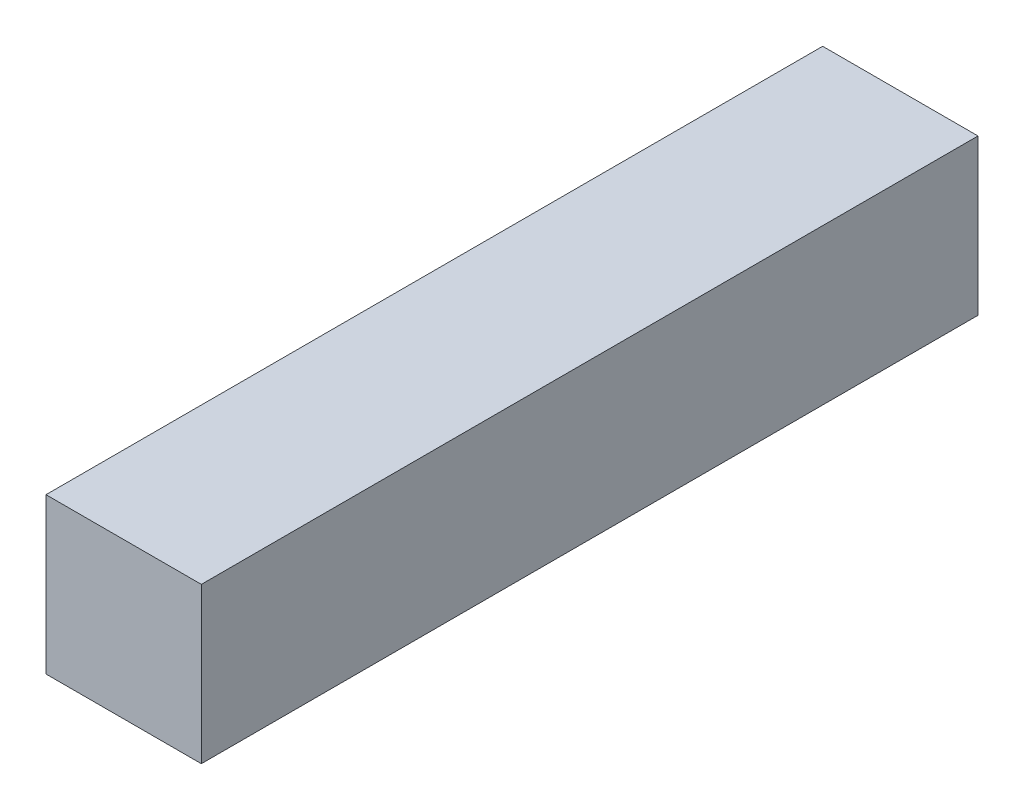
ISO-10303-21;
HEADER;
FILE_DESCRIPTION(('STEP AP214'),'2;1');
FILE_NAME('part.step','',(''),(''),'','','');
FILE_SCHEMA(('AUTOMOTIVE_DESIGN { 1 0 10303 214 1 1 1 1 }'));
ENDSEC;
DATA;
#1=APPLICATION_CONTEXT('core data for automotive mechanical design processes');
#2=APPLICATION_PROTOCOL_DEFINITION('international standard','automotive_design',2000,#1);
#3=PRODUCT_CONTEXT('',#1,'mechanical');
#4=PRODUCT('Part','Part','',(#3));
#5=PRODUCT_RELATED_PRODUCT_CATEGORY('part','',(#4));
#6=PRODUCT_DEFINITION_FORMATION('','',#4);
#7=PRODUCT_DEFINITION_CONTEXT('part definition',#1,'design');
#8=PRODUCT_DEFINITION('design','',#6,#7);
#9=PRODUCT_DEFINITION_SHAPE('','',#8);
#10=(LENGTH_UNIT() NAMED_UNIT(*) SI_UNIT(.MILLI.,.METRE.));
#11=(NAMED_UNIT(*) PLANE_ANGLE_UNIT() SI_UNIT($,.RADIAN.));
#12=(NAMED_UNIT(*) SI_UNIT($,.STERADIAN.) SOLID_ANGLE_UNIT());
#13=UNCERTAINTY_MEASURE_WITH_UNIT(LENGTH_MEASURE(1.E-05),#10,'distance_accuracy_value','');
#14=(GEOMETRIC_REPRESENTATION_CONTEXT(3) GLOBAL_UNCERTAINTY_ASSIGNED_CONTEXT((#13)) GLOBAL_UNIT_ASSIGNED_CONTEXT((#10,
#11,#12)) REPRESENTATION_CONTEXT('',''));
#15=CARTESIAN_POINT('',(0.,0.,0.));
#16=DIRECTION('',(0.,0.,1.));
#17=DIRECTION('',(1.,0.,0.));
#18=AXIS2_PLACEMENT_3D('',#15,#16,#17);
#19=CARTESIAN_POINT('',(0.2499995,0.25000204,0.));
#20=DIRECTION('',(1.,0.,0.));
#21=DIRECTION('',(0.,0.,-1.));
#22=AXIS2_PLACEMENT_3D('',#19,#20,#21);
#23=PLANE('',#22);
#24=DIRECTION('',(0.,0.,-1.));
#25=VECTOR('',#24,1.);
#26=CARTESIAN_POINT('',(0.2499995,-0.2499995,0.));
#27=LINE('',#26,#25);
#28=CARTESIAN_POINT('',(0.2499995,-0.2499995,0.));
#29=VERTEX_POINT('',#28);
#30=CARTESIAN_POINT('',(0.2499995,-0.2499995,2.50000008));
#31=VERTEX_POINT('',#30);
#32=EDGE_CURVE('E61',#29,#31,#27,.F.);
#33=ORIENTED_EDGE('',*,*,#32,.F.);
#34=DIRECTION('',(0.,1.,0.));
#35=VECTOR('',#34,1.);
#36=CARTESIAN_POINT('',(0.2499995,0.25000204,0.));
#37=LINE('',#36,#35);
#38=CARTESIAN_POINT('',(0.2499995,0.25000204,0.));
#39=VERTEX_POINT('',#38);
#40=EDGE_CURVE('E20',#29,#39,#37,.T.);
#41=ORIENTED_EDGE('',*,*,#40,.T.);
#42=DIRECTION('',(0.,0.,1.));
#43=VECTOR('',#42,1.);
#44=CARTESIAN_POINT('',(0.2499995,0.25000204,0.));
#45=LINE('',#44,#43);
#46=CARTESIAN_POINT('',(0.2499995,0.25000204,2.50000008));
#47=VERTEX_POINT('',#46);
#48=EDGE_CURVE('E63',#47,#39,#45,.F.);
#49=ORIENTED_EDGE('',*,*,#48,.F.);
#50=DIRECTION('',(0.,1.,0.));
#51=VECTOR('',#50,1.);
#52=CARTESIAN_POINT('',(0.2499995,-0.2499995,2.50000008));
#53=LINE('',#52,#51);
#54=EDGE_CURVE('E56',#31,#47,#53,.T.);
#55=ORIENTED_EDGE('',*,*,#54,.F.);
#56=EDGE_LOOP('',(#33,#41,#49,#55));
#57=FACE_BOUND('',#56,.T.);
#58=ADVANCED_FACE('F17',(#57),#23,.T.);
#59=CARTESIAN_POINT('',(0.2499995,-0.2499995,0.));
#60=DIRECTION('',(0.,-1.,0.));
#61=DIRECTION('',(0.,0.,-1.));
#62=AXIS2_PLACEMENT_3D('',#59,#60,#61);
#63=PLANE('',#62);
#64=DIRECTION('',(0.,0.,1.));
#65=VECTOR('',#64,1.);
#66=CARTESIAN_POINT('',(-0.2499995,-0.2499995,0.));
#67=LINE('',#66,#65);
#68=CARTESIAN_POINT('',(-0.2499995,-0.2499995,0.));
#69=VERTEX_POINT('',#68);
#70=CARTESIAN_POINT('',(-0.2499995,-0.2499995,2.50000008));
#71=VERTEX_POINT('',#70);
#72=EDGE_CURVE('E83',#69,#71,#67,.T.);
#73=ORIENTED_EDGE('',*,*,#72,.F.);
#74=DIRECTION('',(1.,0.,0.));
#75=VECTOR('',#74,1.);
#76=CARTESIAN_POINT('',(0.2499995,-0.2499995,0.));
#77=LINE('',#76,#75);
#78=EDGE_CURVE('E71',#69,#29,#77,.T.);
#79=ORIENTED_EDGE('',*,*,#78,.T.);
#80=ORIENTED_EDGE('',*,*,#32,.T.);
#81=DIRECTION('',(1.,0.,0.));
#82=VECTOR('',#81,1.);
#83=CARTESIAN_POINT('',(0.2499995,-0.2499995,2.50000008));
#84=LINE('',#83,#82);
#85=EDGE_CURVE('E65',#71,#31,#84,.T.);
#86=ORIENTED_EDGE('',*,*,#85,.F.);
#87=EDGE_LOOP('',(#73,#79,#80,#86));
#88=FACE_BOUND('',#87,.T.);
#89=ADVANCED_FACE('F68',(#88),#63,.T.);
#90=CARTESIAN_POINT('',(0.2499995,-0.2499995,2.50000008));
#91=DIRECTION('',(0.,0.,1.));
#92=DIRECTION('',(1.,0.,0.));
#93=AXIS2_PLACEMENT_3D('',#90,#91,#92);
#94=PLANE('',#93);
#95=DIRECTION('',(0.,1.,0.));
#96=VECTOR('',#95,1.);
#97=CARTESIAN_POINT('',(-0.2499995,-0.2499995,2.50000008));
#98=LINE('',#97,#96);
#99=CARTESIAN_POINT('',(-0.2499995,0.25000204,2.50000008));
#100=VERTEX_POINT('',#99);
#101=EDGE_CURVE('E74',#71,#100,#98,.T.);
#102=ORIENTED_EDGE('',*,*,#101,.F.);
#103=ORIENTED_EDGE('',*,*,#85,.T.);
#104=ORIENTED_EDGE('',*,*,#54,.T.);
#105=DIRECTION('',(1.,0.,0.));
#106=VECTOR('',#105,1.);
#107=CARTESIAN_POINT('',(-0.2499995,0.25000204,2.50000008));
#108=LINE('',#107,#106);
#109=EDGE_CURVE('E76',#100,#47,#108,.T.);
#110=ORIENTED_EDGE('',*,*,#109,.F.);
#111=EDGE_LOOP('',(#102,#103,#104,#110));
#112=FACE_BOUND('',#111,.T.);
#113=ADVANCED_FACE('F72',(#112),#94,.T.);
#114=CARTESIAN_POINT('',(-0.2499995,0.25000204,0.));
#115=DIRECTION('',(0.,1.,0.));
#116=DIRECTION('',(0.,0.,1.));
#117=AXIS2_PLACEMENT_3D('',#114,#115,#116);
#118=PLANE('',#117);
#119=ORIENTED_EDGE('',*,*,#48,.T.);
#120=DIRECTION('',(1.,0.,0.));
#121=VECTOR('',#120,1.);
#122=CARTESIAN_POINT('',(0.2499995,0.25000204,0.));
#123=LINE('',#122,#121);
#124=CARTESIAN_POINT('',(-0.2499995,0.25000204,0.));
#125=VERTEX_POINT('',#124);
#126=EDGE_CURVE('E35',#39,#125,#123,.F.);
#127=ORIENTED_EDGE('',*,*,#126,.T.);
#128=DIRECTION('',(0.,0.,1.));
#129=VECTOR('',#128,1.);
#130=CARTESIAN_POINT('',(-0.2499995,0.25000204,0.));
#131=LINE('',#130,#129);
#132=EDGE_CURVE('E26',#100,#125,#131,.F.);
#133=ORIENTED_EDGE('',*,*,#132,.F.);
#134=ORIENTED_EDGE('',*,*,#109,.T.);
#135=EDGE_LOOP('',(#119,#127,#133,#134));
#136=FACE_BOUND('',#135,.T.);
#137=ADVANCED_FACE('F89',(#136),#118,.T.);
#138=CARTESIAN_POINT('',(0.2499995,-0.2499995,0.));
#139=DIRECTION('',(0.,0.,1.));
#140=DIRECTION('',(1.,0.,0.));
#141=AXIS2_PLACEMENT_3D('',#138,#139,#140);
#142=PLANE('',#141);
#143=DIRECTION('',(0.,1.,0.));
#144=VECTOR('',#143,1.);
#145=CARTESIAN_POINT('',(-0.2499995,-0.2499995,0.));
#146=LINE('',#145,#144);
#147=EDGE_CURVE('E11',#125,#69,#146,.F.);
#148=ORIENTED_EDGE('',*,*,#147,.F.);
#149=ORIENTED_EDGE('',*,*,#126,.F.);
#150=ORIENTED_EDGE('',*,*,#40,.F.);
#151=ORIENTED_EDGE('',*,*,#78,.F.);
#152=EDGE_LOOP('',(#148,#149,#150,#151));
#153=FACE_BOUND('',#152,.T.);
#154=ADVANCED_FACE('F91',(#153),#142,.F.);
#155=CARTESIAN_POINT('',(-0.2499995,-0.2499995,0.));
#156=DIRECTION('',(-1.,0.,0.));
#157=DIRECTION('',(0.,0.,1.));
#158=AXIS2_PLACEMENT_3D('',#155,#156,#157);
#159=PLANE('',#158);
#160=ORIENTED_EDGE('',*,*,#132,.T.);
#161=ORIENTED_EDGE('',*,*,#147,.T.);
#162=ORIENTED_EDGE('',*,*,#72,.T.);
#163=ORIENTED_EDGE('',*,*,#101,.T.);
#164=EDGE_LOOP('',(#160,#161,#162,#163));
#165=FACE_BOUND('',#164,.T.);
#166=ADVANCED_FACE('F88',(#165),#159,.T.);
#167=CLOSED_SHELL('',(#58,#89,#113,#137,#154,#166));
#168=MANIFOLD_SOLID_BREP('B1',#167);
#169=ADVANCED_BREP_SHAPE_REPRESENTATION('',(#18,#168),#14);
#170=SHAPE_DEFINITION_REPRESENTATION(#9,#169);
ENDSEC;
END-ISO-10303-21;
